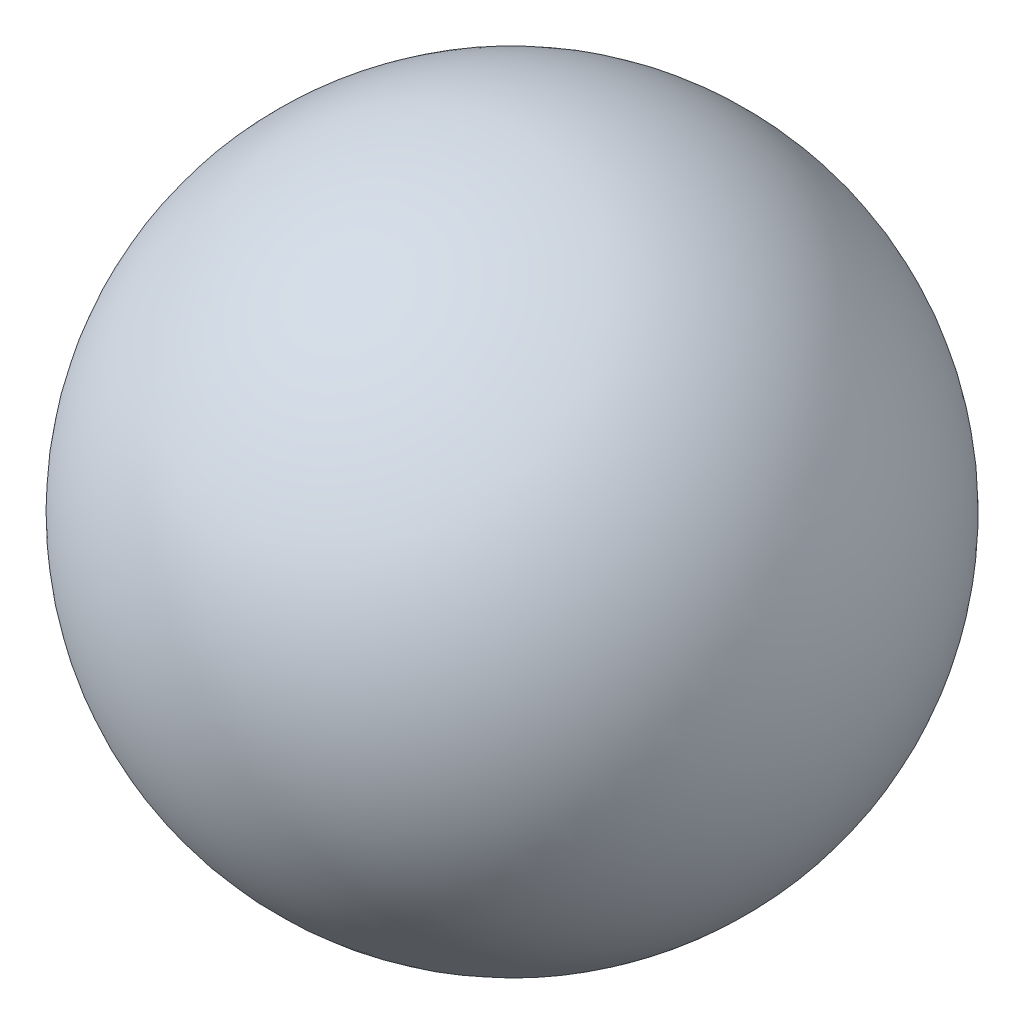
ISO-10303-21;
HEADER;
FILE_DESCRIPTION(('STEP AP214'),'2;1');
FILE_NAME('part.step','',(''),(''),'','','');
FILE_SCHEMA(('AUTOMOTIVE_DESIGN { 1 0 10303 214 1 1 1 1 }'));
ENDSEC;
DATA;
#1=APPLICATION_CONTEXT('core data for automotive mechanical design processes');
#2=APPLICATION_PROTOCOL_DEFINITION('international standard','automotive_design',2000,#1);
#3=PRODUCT_CONTEXT('',#1,'mechanical');
#4=PRODUCT('Part','Part','',(#3));
#5=PRODUCT_RELATED_PRODUCT_CATEGORY('part','',(#4));
#6=PRODUCT_DEFINITION_FORMATION('','',#4);
#7=PRODUCT_DEFINITION_CONTEXT('part definition',#1,'design');
#8=PRODUCT_DEFINITION('design','',#6,#7);
#9=PRODUCT_DEFINITION_SHAPE('','',#8);
#10=(LENGTH_UNIT() NAMED_UNIT(*) SI_UNIT(.MILLI.,.METRE.));
#11=(NAMED_UNIT(*) PLANE_ANGLE_UNIT() SI_UNIT($,.RADIAN.));
#12=(NAMED_UNIT(*) SI_UNIT($,.STERADIAN.) SOLID_ANGLE_UNIT());
#13=UNCERTAINTY_MEASURE_WITH_UNIT(LENGTH_MEASURE(1.E-05),#10,'distance_accuracy_value','');
#14=(GEOMETRIC_REPRESENTATION_CONTEXT(3) GLOBAL_UNCERTAINTY_ASSIGNED_CONTEXT((#13)) GLOBAL_UNIT_ASSIGNED_CONTEXT((#10,
#11,#12)) REPRESENTATION_CONTEXT('',''));
#15=CARTESIAN_POINT('',(0.,0.,0.));
#16=DIRECTION('',(0.,0.,1.));
#17=DIRECTION('',(1.,0.,0.));
#18=AXIS2_PLACEMENT_3D('',#15,#16,#17);
#19=CARTESIAN_POINT('',(64.16,65.1716395731667,23.8045811629915));
#20=DIRECTION('',(0.,0.93930270488687,0.343089534367084));
#21=DIRECTION('',(0.173648177666934,-0.33787723342205,0.925032586197921));
#22=AXIS2_PLACEMENT_3D('',#19,#20,#21);
#23=SPHERICAL_SURFACE('',#22,7.15);
#24=CARTESIAN_POINT('',(64.16,58.4556252332257,21.3514909922668));
#25=VERTEX_POINT('',#24);
#26=VERTEX_LOOP('',#25);
#27=FACE_BOUND('',#26,.T.);
#28=CARTESIAN_POINT('',(64.16,71.8876539131078,26.2576713337161));
#29=VERTEX_POINT('',#28);
#30=VERTEX_LOOP('',#29);
#31=FACE_BOUND('',#30,.T.);
#32=ADVANCED_FACE('F23',(#27,#31),#23,.T.);
#33=CLOSED_SHELL('',(#32));
#34=MANIFOLD_SOLID_BREP('B1',#33);
#35=ADVANCED_BREP_SHAPE_REPRESENTATION('',(#18,#34),#14);
#36=SHAPE_DEFINITION_REPRESENTATION(#9,#35);
ENDSEC;
END-ISO-10303-21;
